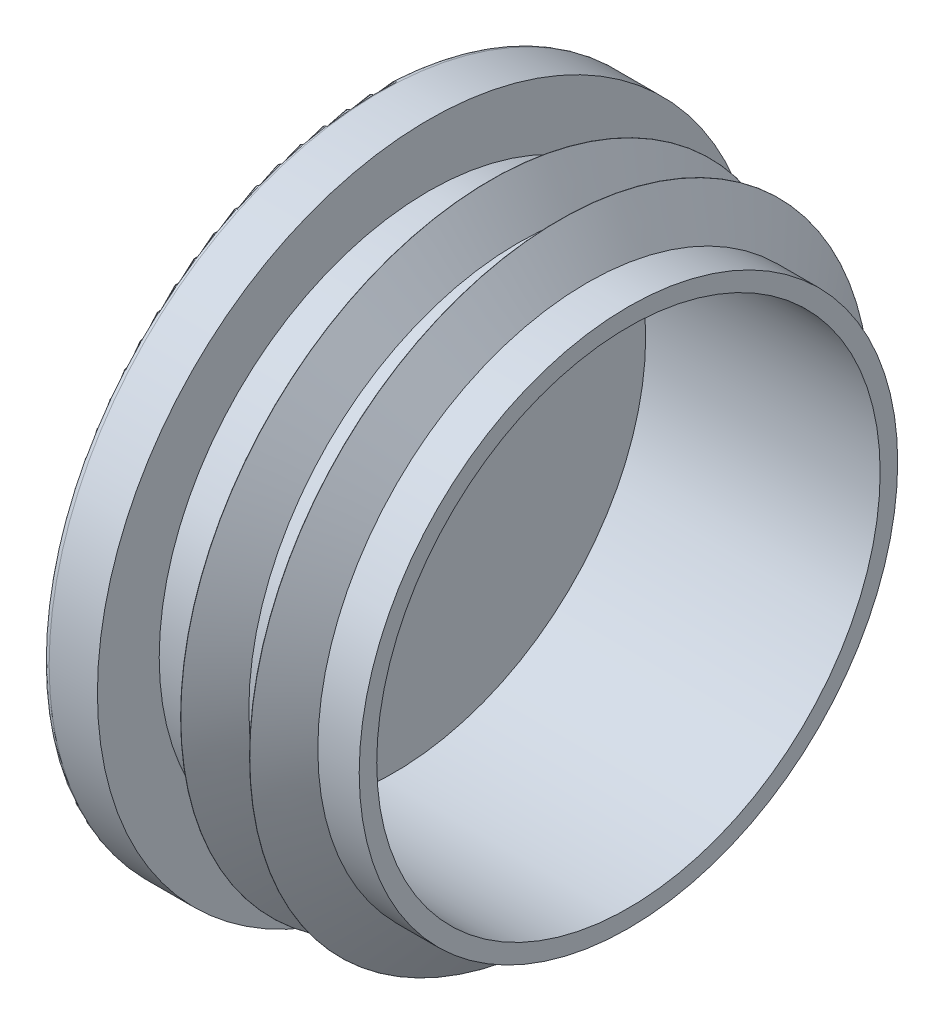
ISO-10303-21;
HEADER;
FILE_DESCRIPTION(('STEP AP214'),'2;1');
FILE_NAME('part.step','',(''),(''),'','','');
FILE_SCHEMA(('AUTOMOTIVE_DESIGN { 1 0 10303 214 1 1 1 1 }'));
ENDSEC;
DATA;
#1=APPLICATION_CONTEXT('core data for automotive mechanical design processes');
#2=APPLICATION_PROTOCOL_DEFINITION('international standard','automotive_design',2000,#1);
#3=PRODUCT_CONTEXT('',#1,'mechanical');
#4=PRODUCT('Part','Part','',(#3));
#5=PRODUCT_RELATED_PRODUCT_CATEGORY('part','',(#4));
#6=PRODUCT_DEFINITION_FORMATION('','',#4);
#7=PRODUCT_DEFINITION_CONTEXT('part definition',#1,'design');
#8=PRODUCT_DEFINITION('design','',#6,#7);
#9=PRODUCT_DEFINITION_SHAPE('','',#8);
#10=(LENGTH_UNIT() NAMED_UNIT(*) SI_UNIT(.MILLI.,.METRE.));
#11=(NAMED_UNIT(*) PLANE_ANGLE_UNIT() SI_UNIT($,.RADIAN.));
#12=(NAMED_UNIT(*) SI_UNIT($,.STERADIAN.) SOLID_ANGLE_UNIT());
#13=UNCERTAINTY_MEASURE_WITH_UNIT(LENGTH_MEASURE(1.E-05),#10,'distance_accuracy_value','');
#14=(GEOMETRIC_REPRESENTATION_CONTEXT(3) GLOBAL_UNCERTAINTY_ASSIGNED_CONTEXT((#13)) GLOBAL_UNIT_ASSIGNED_CONTEXT((#10,
#11,#12)) REPRESENTATION_CONTEXT('',''));
#15=CARTESIAN_POINT('',(0.,0.,0.));
#16=DIRECTION('',(0.,0.,1.));
#17=DIRECTION('',(1.,0.,0.));
#18=AXIS2_PLACEMENT_3D('',#15,#16,#17);
#19=CARTESIAN_POINT('',(0.,0.,0.));
#20=DIRECTION('',(-1.,0.,0.));
#21=DIRECTION('',(0.,0.,1.));
#22=AXIS2_PLACEMENT_3D('',#19,#20,#21);
#23=PLANE('',#22);
#24=CARTESIAN_POINT('',(0.,0.,0.));
#25=DIRECTION('',(-1.,0.,0.));
#26=DIRECTION('',(0.,0.,1.));
#27=AXIS2_PLACEMENT_3D('',#24,#25,#26);
#28=CIRCLE('',#27,23.5);
#29=CARTESIAN_POINT('',(0.,0.,23.5));
#30=VERTEX_POINT('',#29);
#31=EDGE_CURVE('E40',#30,#30,#28,.T.);
#32=ORIENTED_EDGE('',*,*,#31,.T.);
#33=EDGE_LOOP('',(#32));
#34=FACE_BOUND('',#33,.T.);
#35=ADVANCED_FACE('F33',(#34),#23,.T.);
#36=CARTESIAN_POINT('',(1.5,0.,0.));
#37=DIRECTION('',(1.,0.,0.));
#38=DIRECTION('',(0.,0.,-1.));
#39=AXIS2_PLACEMENT_3D('',#36,#37,#38);
#40=PLANE('',#39);
#41=CARTESIAN_POINT('',(1.5,0.,0.));
#42=DIRECTION('',(-1.,0.,0.));
#43=DIRECTION('',(0.,0.,1.));
#44=AXIS2_PLACEMENT_3D('',#41,#42,#43);
#45=CIRCLE('',#44,18.25);
#46=CARTESIAN_POINT('',(1.5,0.,18.25));
#47=VERTEX_POINT('',#46);
#48=EDGE_CURVE('E59',#47,#47,#45,.T.);
#49=ORIENTED_EDGE('',*,*,#48,.F.);
#50=EDGE_LOOP('',(#49));
#51=FACE_BOUND('',#50,.T.);
#52=ADVANCED_FACE('F104',(#51),#40,.T.);
#53=CARTESIAN_POINT('',(0.,0.,0.));
#54=DIRECTION('',(-1.,0.,0.));
#55=DIRECTION('',(0.,0.,1.));
#56=AXIS2_PLACEMENT_3D('',#53,#54,#55);
#57=CYLINDRICAL_SURFACE('',#56,18.25);
#58=ORIENTED_EDGE('',*,*,#48,.T.);
#59=EDGE_LOOP('',(#58));
#60=FACE_BOUND('',#59,.T.);
#61=CARTESIAN_POINT('',(18.5,0.,0.));
#62=DIRECTION('',(-1.,0.,0.));
#63=DIRECTION('',(0.,0.,1.));
#64=AXIS2_PLACEMENT_3D('',#61,#62,#63);
#65=CIRCLE('',#64,18.25);
#66=CARTESIAN_POINT('',(18.5,0.,18.25));
#67=VERTEX_POINT('',#66);
#68=EDGE_CURVE('E62',#67,#67,#65,.T.);
#69=ORIENTED_EDGE('',*,*,#68,.F.);
#70=EDGE_LOOP('',(#69));
#71=FACE_BOUND('',#70,.T.);
#72=ADVANCED_FACE('F109',(#60,#71),#57,.F.);
#73=CARTESIAN_POINT('',(18.5,0.,0.));
#74=DIRECTION('',(1.,0.,0.));
#75=DIRECTION('',(0.,0.,-1.));
#76=AXIS2_PLACEMENT_3D('',#73,#74,#75);
#77=PLANE('',#76);
#78=ORIENTED_EDGE('',*,*,#68,.T.);
#79=EDGE_LOOP('',(#78));
#80=FACE_BOUND('',#79,.T.);
#81=CARTESIAN_POINT('',(18.5,0.,0.));
#82=DIRECTION('',(-1.,0.,0.));
#83=DIRECTION('',(0.,0.,1.));
#84=AXIS2_PLACEMENT_3D('',#81,#82,#83);
#85=CIRCLE('',#84,19.5211760824602);
#86=CARTESIAN_POINT('',(18.5,0.,19.5211760824602));
#87=VERTEX_POINT('',#86);
#88=EDGE_CURVE('E65',#87,#87,#85,.T.);
#89=ORIENTED_EDGE('',*,*,#88,.F.);
#90=EDGE_LOOP('',(#89));
#91=FACE_BOUND('',#90,.T.);
#92=ADVANCED_FACE('F155',(#80,#91),#77,.T.);
#93=CARTESIAN_POINT('',(0.,0.,0.));
#94=DIRECTION('',(-1.,0.,0.));
#95=DIRECTION('',(0.,0.,1.));
#96=AXIS2_PLACEMENT_3D('',#93,#94,#95);
#97=CYLINDRICAL_SURFACE('',#96,19.5211760824602);
#98=ORIENTED_EDGE('',*,*,#88,.T.);
#99=EDGE_LOOP('',(#98));
#100=FACE_BOUND('',#99,.T.);
#101=CARTESIAN_POINT('',(15.5,0.,0.));
#102=DIRECTION('',(-1.,0.,0.));
#103=DIRECTION('',(0.,0.,1.));
#104=AXIS2_PLACEMENT_3D('',#101,#102,#103);
#105=CIRCLE('',#104,19.5211760824602);
#106=CARTESIAN_POINT('',(15.5,0.,19.5211760824602));
#107=VERTEX_POINT('',#106);
#108=EDGE_CURVE('E68',#107,#107,#105,.T.);
#109=ORIENTED_EDGE('',*,*,#108,.F.);
#110=EDGE_LOOP('',(#109));
#111=FACE_BOUND('',#110,.T.);
#112=ADVANCED_FACE('F151',(#100,#111),#97,.T.);
#113=CARTESIAN_POINT('',(13.5,0.,0.));
#114=DIRECTION('',(-1.,0.,0.));
#115=DIRECTION('',(0.,0.,1.));
#116=AXIS2_PLACEMENT_3D('',#113,#114,#115);
#117=CONICAL_SURFACE('',#116,22.5,0.979519877455447);
#118=CARTESIAN_POINT('',(13.518302298357,0.,0.));
#119=DIRECTION('',(1.,0.,0.));
#120=DIRECTION('',(0.,0.,-1.));
#121=AXIS2_PLACEMENT_3D('',#118,#119,#120);
#122=CIRCLE('',#121,22.4727403379541);
#123=CARTESIAN_POINT('',(13.518302298357,0.,-22.4727403379541));
#124=VERTEX_POINT('',#123);
#125=EDGE_CURVE('E53',#124,#124,#122,.T.);
#126=ORIENTED_EDGE('',*,*,#125,.T.);
#127=EDGE_LOOP('',(#126));
#128=FACE_BOUND('',#127,.T.);
#129=ORIENTED_EDGE('',*,*,#108,.T.);
#130=EDGE_LOOP('',(#129));
#131=FACE_BOUND('',#130,.T.);
#132=ADVANCED_FACE('F147',(#128,#131),#117,.T.);
#133=CARTESIAN_POINT('',(13.5,0.,0.));
#134=DIRECTION('',(-1.,0.,0.));
#135=DIRECTION('',(0.,0.,1.));
#136=AXIS2_PLACEMENT_3D('',#133,#134,#135);
#137=PLANE('',#136);
#138=CARTESIAN_POINT('',(13.5,0.,0.));
#139=DIRECTION('',(-1.,0.,0.));
#140=DIRECTION('',(0.,0.,1.));
#141=AXIS2_PLACEMENT_3D('',#138,#139,#140);
#142=CIRCLE('',#141,22.4671661257235);
#143=CARTESIAN_POINT('',(13.5,0.,22.4671661257235));
#144=VERTEX_POINT('',#143);
#145=EDGE_CURVE('E56',#144,#144,#142,.T.);
#146=ORIENTED_EDGE('',*,*,#145,.T.);
#147=EDGE_LOOP('',(#146));
#148=FACE_BOUND('',#147,.T.);
#149=CARTESIAN_POINT('',(13.5,0.,0.));
#150=DIRECTION('',(-1.,0.,0.));
#151=DIRECTION('',(0.,0.,1.));
#152=AXIS2_PLACEMENT_3D('',#149,#150,#151);
#153=CIRCLE('',#152,19.5211760824602);
#154=CARTESIAN_POINT('',(13.5,0.,19.5211760824602));
#155=VERTEX_POINT('',#154);
#156=EDGE_CURVE('E71',#155,#155,#153,.T.);
#157=ORIENTED_EDGE('',*,*,#156,.F.);
#158=EDGE_LOOP('',(#157));
#159=FACE_BOUND('',#158,.T.);
#160=ADVANCED_FACE('F143',(#148,#159),#137,.T.);
#161=CARTESIAN_POINT('',(0.,0.,0.));
#162=DIRECTION('',(-1.,0.,0.));
#163=DIRECTION('',(0.,0.,1.));
#164=AXIS2_PLACEMENT_3D('',#161,#162,#163);
#165=CYLINDRICAL_SURFACE('',#164,19.5211760824602);
#166=ORIENTED_EDGE('',*,*,#156,.T.);
#167=EDGE_LOOP('',(#166));
#168=FACE_BOUND('',#167,.T.);
#169=CARTESIAN_POINT('',(10.5,0.,0.));
#170=DIRECTION('',(-1.,0.,0.));
#171=DIRECTION('',(0.,0.,1.));
#172=AXIS2_PLACEMENT_3D('',#169,#170,#171);
#173=CIRCLE('',#172,19.5211760824602);
#174=CARTESIAN_POINT('',(10.5,0.,19.5211760824602));
#175=VERTEX_POINT('',#174);
#176=EDGE_CURVE('E74',#175,#175,#173,.T.);
#177=ORIENTED_EDGE('',*,*,#176,.F.);
#178=EDGE_LOOP('',(#177));
#179=FACE_BOUND('',#178,.T.);
#180=ADVANCED_FACE('F137',(#168,#179),#165,.T.);
#181=CARTESIAN_POINT('',(8.5,0.,0.));
#182=DIRECTION('',(-1.,0.,0.));
#183=DIRECTION('',(0.,0.,1.));
#184=AXIS2_PLACEMENT_3D('',#181,#182,#183);
#185=CONICAL_SURFACE('',#184,22.5,0.979519877455446);
#186=CARTESIAN_POINT('',(8.51830229835698,0.,0.));
#187=DIRECTION('',(1.,0.,0.));
#188=DIRECTION('',(0.,0.,-1.));
#189=AXIS2_PLACEMENT_3D('',#186,#187,#188);
#190=CIRCLE('',#189,22.4727403379541);
#191=CARTESIAN_POINT('',(8.51830229835698,0.,-22.4727403379541));
#192=VERTEX_POINT('',#191);
#193=EDGE_CURVE('E44',#192,#192,#190,.T.);
#194=ORIENTED_EDGE('',*,*,#193,.T.);
#195=EDGE_LOOP('',(#194));
#196=FACE_BOUND('',#195,.T.);
#197=ORIENTED_EDGE('',*,*,#176,.T.);
#198=EDGE_LOOP('',(#197));
#199=FACE_BOUND('',#198,.T.);
#200=ADVANCED_FACE('F129',(#196,#199),#185,.T.);
#201=CARTESIAN_POINT('',(8.5,0.,0.));
#202=DIRECTION('',(-1.,0.,0.));
#203=DIRECTION('',(0.,0.,1.));
#204=AXIS2_PLACEMENT_3D('',#201,#202,#203);
#205=PLANE('',#204);
#206=CARTESIAN_POINT('',(8.5,0.,0.));
#207=DIRECTION('',(-1.,0.,0.));
#208=DIRECTION('',(0.,0.,1.));
#209=AXIS2_PLACEMENT_3D('',#206,#207,#208);
#210=CIRCLE('',#209,22.4671661257235);
#211=CARTESIAN_POINT('',(8.5,0.,22.4671661257235));
#212=VERTEX_POINT('',#211);
#213=EDGE_CURVE('E48',#212,#212,#210,.T.);
#214=ORIENTED_EDGE('',*,*,#213,.T.);
#215=EDGE_LOOP('',(#214));
#216=FACE_BOUND('',#215,.T.);
#217=CARTESIAN_POINT('',(8.5,0.,0.));
#218=DIRECTION('',(-1.,0.,0.));
#219=DIRECTION('',(0.,0.,1.));
#220=AXIS2_PLACEMENT_3D('',#217,#218,#219);
#221=CIRCLE('',#220,19.5211760824602);
#222=CARTESIAN_POINT('',(8.5,0.,19.5211760824602));
#223=VERTEX_POINT('',#222);
#224=EDGE_CURVE('E77',#223,#223,#221,.T.);
#225=ORIENTED_EDGE('',*,*,#224,.F.);
#226=EDGE_LOOP('',(#225));
#227=FACE_BOUND('',#226,.T.);
#228=ADVANCED_FACE('F100',(#216,#227),#205,.T.);
#229=CARTESIAN_POINT('',(0.,0.,0.));
#230=DIRECTION('',(-1.,0.,0.));
#231=DIRECTION('',(0.,0.,1.));
#232=AXIS2_PLACEMENT_3D('',#229,#230,#231);
#233=CYLINDRICAL_SURFACE('',#232,19.5211760824602);
#234=ORIENTED_EDGE('',*,*,#224,.T.);
#235=EDGE_LOOP('',(#234));
#236=FACE_BOUND('',#235,.T.);
#237=CARTESIAN_POINT('',(4.,0.,0.));
#238=DIRECTION('',(-1.,0.,0.));
#239=DIRECTION('',(0.,0.,1.));
#240=AXIS2_PLACEMENT_3D('',#237,#238,#239);
#241=CIRCLE('',#240,19.5211760824602);
#242=CARTESIAN_POINT('',(4.,0.,19.5211760824602));
#243=VERTEX_POINT('',#242);
#244=EDGE_CURVE('E80',#243,#243,#241,.T.);
#245=ORIENTED_EDGE('',*,*,#244,.F.);
#246=EDGE_LOOP('',(#245));
#247=FACE_BOUND('',#246,.T.);
#248=ADVANCED_FACE('F91',(#236,#247),#233,.T.);
#249=CARTESIAN_POINT('',(4.,0.,0.));
#250=DIRECTION('',(1.,0.,0.));
#251=DIRECTION('',(0.,0.,-1.));
#252=AXIS2_PLACEMENT_3D('',#249,#250,#251);
#253=PLANE('',#252);
#254=ORIENTED_EDGE('',*,*,#244,.T.);
#255=EDGE_LOOP('',(#254));
#256=FACE_BOUND('',#255,.T.);
#257=CARTESIAN_POINT('',(4.,0.,0.));
#258=DIRECTION('',(-1.,0.,0.));
#259=DIRECTION('',(0.,0.,1.));
#260=AXIS2_PLACEMENT_3D('',#257,#258,#259);
#261=CIRCLE('',#260,24.);
#262=CARTESIAN_POINT('',(4.,0.,24.));
#263=VERTEX_POINT('',#262);
#264=EDGE_CURVE('E83',#263,#263,#261,.T.);
#265=ORIENTED_EDGE('',*,*,#264,.F.);
#266=EDGE_LOOP('',(#265));
#267=FACE_BOUND('',#266,.T.);
#268=ADVANCED_FACE('F89',(#256,#267),#253,.T.);
#269=CARTESIAN_POINT('',(0.,0.,0.));
#270=DIRECTION('',(-1.,0.,0.));
#271=DIRECTION('',(0.,0.,1.));
#272=AXIS2_PLACEMENT_3D('',#269,#270,#271);
#273=CYLINDRICAL_SURFACE('',#272,24.);
#274=CARTESIAN_POINT('',(0.5,0.,0.));
#275=DIRECTION('',(-1.,0.,0.));
#276=DIRECTION('',(0.,0.,1.));
#277=AXIS2_PLACEMENT_3D('',#274,#275,#276);
#278=CIRCLE('',#277,24.);
#279=CARTESIAN_POINT('',(0.5,0.,24.));
#280=VERTEX_POINT('',#279);
#281=EDGE_CURVE('E10',#280,#280,#278,.F.);
#282=ORIENTED_EDGE('',*,*,#281,.T.);
#283=EDGE_LOOP('',(#282));
#284=FACE_BOUND('',#283,.T.);
#285=ORIENTED_EDGE('',*,*,#264,.T.);
#286=EDGE_LOOP('',(#285));
#287=FACE_BOUND('',#286,.T.);
#288=ADVANCED_FACE('F87',(#284,#287),#273,.T.);
#289=CARTESIAN_POINT('',(13.51,0.,0.));
#290=DIRECTION('',(-1.,0.,0.));
#291=DIRECTION('',(0.,0.,1.));
#292=AXIS2_PLACEMENT_3D('',#289,#290,#291);
#293=TOROIDAL_SURFACE('',#292,22.4671661257235,0.01);
#294=ORIENTED_EDGE('',*,*,#125,.F.);
#295=EDGE_LOOP('',(#294));
#296=FACE_BOUND('',#295,.T.);
#297=ORIENTED_EDGE('',*,*,#145,.F.);
#298=EDGE_LOOP('',(#297));
#299=FACE_BOUND('',#298,.T.);
#300=ADVANCED_FACE('F98',(#296,#299),#293,.T.);
#301=CARTESIAN_POINT('',(8.51,0.,0.));
#302=DIRECTION('',(-1.,0.,0.));
#303=DIRECTION('',(0.,0.,1.));
#304=AXIS2_PLACEMENT_3D('',#301,#302,#303);
#305=TOROIDAL_SURFACE('',#304,22.4671661257235,0.01);
#306=ORIENTED_EDGE('',*,*,#193,.F.);
#307=EDGE_LOOP('',(#306));
#308=FACE_BOUND('',#307,.T.);
#309=ORIENTED_EDGE('',*,*,#213,.F.);
#310=EDGE_LOOP('',(#309));
#311=FACE_BOUND('',#310,.T.);
#312=ADVANCED_FACE('F115',(#308,#311),#305,.T.);
#313=CARTESIAN_POINT('',(0.5,0.,0.));
#314=DIRECTION('',(-1.,0.,0.));
#315=DIRECTION('',(0.,0.,1.));
#316=AXIS2_PLACEMENT_3D('',#313,#314,#315);
#317=TOROIDAL_SURFACE('',#316,23.5,0.5);
#318=ORIENTED_EDGE('',*,*,#281,.F.);
#319=EDGE_LOOP('',(#318));
#320=FACE_BOUND('',#319,.T.);
#321=ORIENTED_EDGE('',*,*,#31,.F.);
#322=EDGE_LOOP('',(#321));
#323=FACE_BOUND('',#322,.T.);
#324=ADVANCED_FACE('F35',(#320,#323),#317,.T.);
#325=CLOSED_SHELL('',(#35,#52,#72,#92,#112,#132,#160,#180,#200,#228,#248,#268,#288,#300,#312,#324));
#326=MANIFOLD_SOLID_BREP('B2',#325);
#327=ADVANCED_BREP_SHAPE_REPRESENTATION('',(#18,#326),#14);
#328=SHAPE_DEFINITION_REPRESENTATION(#9,#327);
ENDSEC;
END-ISO-10303-21;
